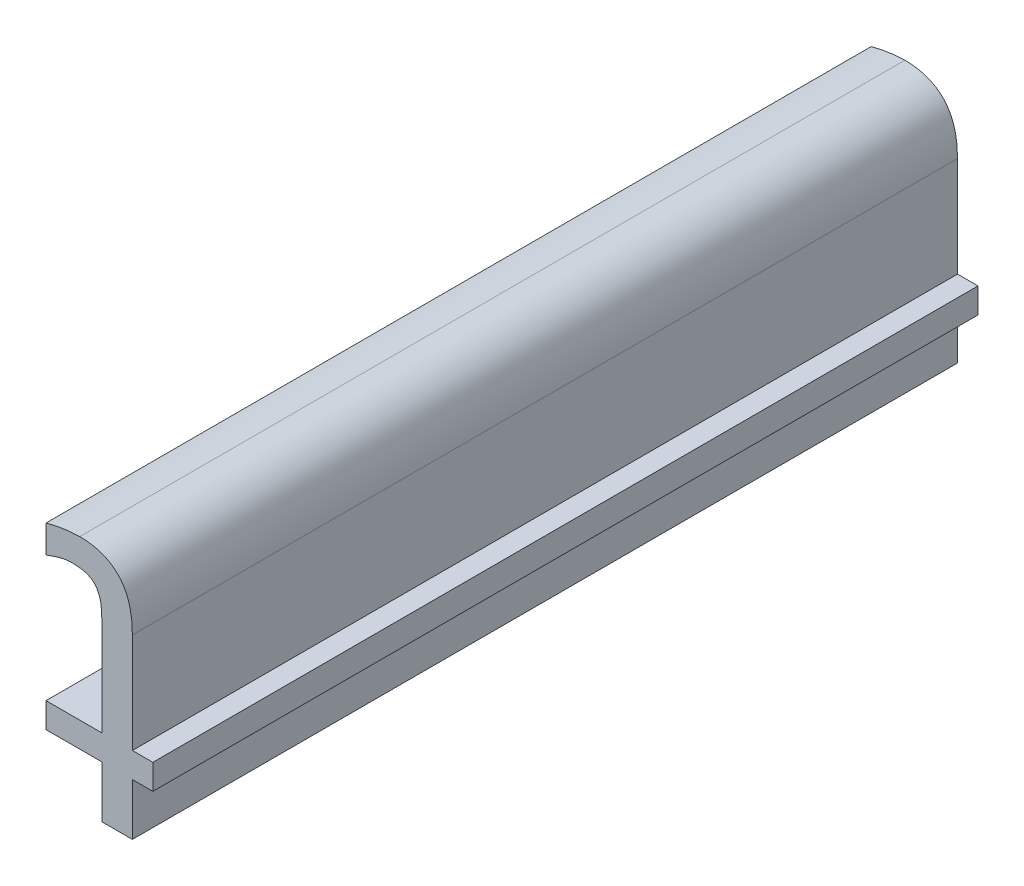
ISO-10303-21;
HEADER;
FILE_DESCRIPTION(('STEP AP214'),'2;1');
FILE_NAME('part.step','',(''),(''),'','','');
FILE_SCHEMA(('AUTOMOTIVE_DESIGN { 1 0 10303 214 1 1 1 1 }'));
ENDSEC;
DATA;
#1=APPLICATION_CONTEXT('core data for automotive mechanical design processes');
#2=APPLICATION_PROTOCOL_DEFINITION('international standard','automotive_design',2000,#1);
#3=PRODUCT_CONTEXT('',#1,'mechanical');
#4=PRODUCT('Part','Part','',(#3));
#5=PRODUCT_RELATED_PRODUCT_CATEGORY('part','',(#4));
#6=PRODUCT_DEFINITION_FORMATION('','',#4);
#7=PRODUCT_DEFINITION_CONTEXT('part definition',#1,'design');
#8=PRODUCT_DEFINITION('design','',#6,#7);
#9=PRODUCT_DEFINITION_SHAPE('','',#8);
#10=(LENGTH_UNIT() NAMED_UNIT(*) SI_UNIT(.MILLI.,.METRE.));
#11=(NAMED_UNIT(*) PLANE_ANGLE_UNIT() SI_UNIT($,.RADIAN.));
#12=(NAMED_UNIT(*) SI_UNIT($,.STERADIAN.) SOLID_ANGLE_UNIT());
#13=UNCERTAINTY_MEASURE_WITH_UNIT(LENGTH_MEASURE(1.E-05),#10,'distance_accuracy_value','');
#14=(GEOMETRIC_REPRESENTATION_CONTEXT(3) GLOBAL_UNCERTAINTY_ASSIGNED_CONTEXT((#13)) GLOBAL_UNIT_ASSIGNED_CONTEXT((#10,
#11,#12)) REPRESENTATION_CONTEXT('',''));
#15=CARTESIAN_POINT('',(0.,0.,0.));
#16=DIRECTION('',(0.,0.,1.));
#17=DIRECTION('',(1.,0.,0.));
#18=AXIS2_PLACEMENT_3D('',#15,#16,#17);
#19=CARTESIAN_POINT('',(5.05130988859926,3.57171991261188,0.));
#20=CARTESIAN_POINT('',(5.05130988859926,3.57171991261188,0.1));
#21=CARTESIAN_POINT('',(5.05149312006613,3.57180007637894,0.));
#22=CARTESIAN_POINT('',(5.05149312006613,3.57180007637894,0.1));
#23=CARTESIAN_POINT('',(5.051676351533,3.571880240146,0.));
#24=CARTESIAN_POINT('',(5.051676351533,3.571880240146,0.1));
#25=CARTESIAN_POINT('',(5.052054439095,3.572045653455,0.));
#26=CARTESIAN_POINT('',(5.052054439095,3.572045653455,0.1));
#27=CARTESIAN_POINT('',(5.053732202649,3.572589154324,0.));
#28=CARTESIAN_POINT('',(5.053732202649,3.572589154324,0.1));
#29=CARTESIAN_POINT('',(5.054630160607,3.572589154324,0.));
#30=CARTESIAN_POINT('',(5.054630160607,3.572589154324,0.1));
#31=B_SPLINE_SURFACE_WITH_KNOTS('',2,1,((#19,#20),(#21,#22),(#23,#24),(#25,#26),(#27,#28),(#29,
#30)),.UNSPECIFIED.,.F.,.F.,.F.,(3,2,1,3),(2,2),(-2.48462706866026,-2.,-1.,0.),(0.,0.01),.UNSPECIFIED.);
#32=CARTESIAN_POINT('',(5.05149784461922,3.57180214337093,0.1));
#33=CARTESIAN_POINT('',(5.05192434530063,3.57197394980912,0.1));
#34=CARTESIAN_POINT('',(5.05235965517821,3.57214782170709,0.1));
#35=CARTESIAN_POINT('',(5.05309863974709,3.57238152407593,0.1));
#36=CARTESIAN_POINT('',(5.05339717863607,3.57246003887685,0.1));
#37=CARTESIAN_POINT('',(5.05400570237596,3.57256779812829,0.1));
#38=CARTESIAN_POINT('',(5.0543157749303,3.57259651228612,0.1));
#39=CARTESIAN_POINT('',(5.054630160607,3.572589154324,0.1));
#40=B_SPLINE_CURVE_WITH_KNOTS('',3,(#32,#33,#34,#35,#36,#37,#38,#39),.UNSPECIFIED.,.F.,.F.,(4,2,
2,4),(0.,0.00139383914533155,0.00231744530987177,0.0032508272847861),.UNSPECIFIED.);
#41=CARTESIAN_POINT('',(5.05148076094961,3.57184119175846,0.1));
#42=VERTEX_POINT('',#41);
#43=CARTESIAN_POINT('',(5.054630160607,3.572589154324,0.1));
#44=VERTEX_POINT('',#43);
#45=EDGE_CURVE('E208',#42,#44,#40,.T.);
#46=DIRECTION('',(0.,0.,1.));
#47=VECTOR('',#46,1.);
#48=CARTESIAN_POINT('',(5.05146367728,3.57178719515996,0.));
#49=LINE('',#48,#47);
#50=CARTESIAN_POINT('',(5.05148076094961,3.57184119175846,0.));
#51=VERTEX_POINT('',#50);
#52=EDGE_CURVE('E146',#51,#42,#49,.T.);
#53=CARTESIAN_POINT('',(5.05149784461922,3.57180214337093,0.));
#54=CARTESIAN_POINT('',(5.05192434530063,3.57197394980912,0.));
#55=CARTESIAN_POINT('',(5.05235965517821,3.57214782170709,0.));
#56=CARTESIAN_POINT('',(5.05309863974709,3.57238152407593,0.));
#57=CARTESIAN_POINT('',(5.05339717863607,3.57246003887685,0.));
#58=CARTESIAN_POINT('',(5.05400570237596,3.57256779812829,0.));
#59=CARTESIAN_POINT('',(5.0543157749303,3.57259651228612,0.));
#60=CARTESIAN_POINT('',(5.054630160607,3.572589154324,0.));
#61=B_SPLINE_CURVE_WITH_KNOTS('',3,(#53,#54,#55,#56,#57,#58,#59,#60),.UNSPECIFIED.,.F.,.F.,(4,2,
2,4),(0.,0.00139383914533043,0.00231744530987161,0.00325082728478593),.UNSPECIFIED.);
#62=CARTESIAN_POINT('',(5.054630160607,3.572589154324,0.));
#63=VERTEX_POINT('',#62);
#64=EDGE_CURVE('E142',#51,#63,#61,.T.);
#65=DIRECTION('',(0.,0.,-1.));
#66=VECTOR('',#65,1.);
#67=CARTESIAN_POINT('',(5.054630160607,3.572589154324,0.05));
#68=LINE('',#67,#66);
#69=EDGE_CURVE('E143',#44,#63,#68,.T.);
#70=ORIENTED_EDGE('',*,*,#45,.F.);
#71=ORIENTED_EDGE('',*,*,#52,.F.);
#72=ORIENTED_EDGE('',*,*,#64,.T.);
#73=ORIENTED_EDGE('',*,*,#69,.F.);
#74=EDGE_LOOP('',(#70,#71,#72,#73));
#75=FACE_BOUND('',#74,.T.);
#76=ADVANCED_FACE('F17',(#75),#31,.T.);
#77=CARTESIAN_POINT('',(5.054630160607,3.572589154324,0.));
#78=CARTESIAN_POINT('',(5.054630160607,3.572589154324,0.1));
#79=CARTESIAN_POINT('',(5.055906206127,3.572589154324,0.));
#80=CARTESIAN_POINT('',(5.055906206127,3.572589154324,0.1));
#81=CARTESIAN_POINT('',(5.057394925901,3.571903870619,0.));
#82=CARTESIAN_POINT('',(5.057394925901,3.571903870619,0.1));
#83=CARTESIAN_POINT('',(5.057725752517,3.571218586914,0.));
#84=CARTESIAN_POINT('',(5.057725752517,3.571218586914,0.1));
#85=B_SPLINE_SURFACE_WITH_KNOTS('',2,1,((#77,#78),(#79,#80),(#81,#82),(#83,#84)),.UNSPECIFIED.,
.F.,.F.,.F.,(3,1,3),(2,2),(-2.,-1.,0.),(0.,0.01),.UNSPECIFIED.);
#86=CARTESIAN_POINT('',(5.054630160607,3.572589154324,0.1));
#87=CARTESIAN_POINT('',(5.05496094504542,3.57258669764763,0.1));
#88=CARTESIAN_POINT('',(5.05530980381784,3.57257162553546,0.1));
#89=CARTESIAN_POINT('',(5.05599415889853,3.57247347746855,0.1));
#90=CARTESIAN_POINT('',(5.05632971669296,3.57239076563969,0.1));
#91=CARTESIAN_POINT('',(5.05708770635305,3.57205022235931,0.1));
#92=CARTESIAN_POINT('',(5.05747595385612,3.57172797974795,0.1));
#93=CARTESIAN_POINT('',(5.05772575250342,3.57121858694212,0.1));
#94=B_SPLINE_CURVE_WITH_KNOTS('',3,(#86,#87,#88,#89,#90,#91,#92,#93),.UNSPECIFIED.,.F.,.F.,(4,2,
2,4),(0.,0.00102491313422835,0.00204434487886826,0.00354685890841517),.UNSPECIFIED.);
#95=CARTESIAN_POINT('',(5.057725752517,3.571218586914,0.1));
#96=VERTEX_POINT('',#95);
#97=EDGE_CURVE('E154',#44,#96,#94,.T.);
#98=CARTESIAN_POINT('',(5.054630160607,3.572589154324,0.));
#99=CARTESIAN_POINT('',(5.05496094504542,3.57258669764763,0.));
#100=CARTESIAN_POINT('',(5.05530980381784,3.57257162553546,0.));
#101=CARTESIAN_POINT('',(5.05599415889853,3.57247347746855,0.));
#102=CARTESIAN_POINT('',(5.05632971669296,3.57239076563969,0.));
#103=CARTESIAN_POINT('',(5.05708770635305,3.57205022235931,0.));
#104=CARTESIAN_POINT('',(5.05747595385612,3.57172797974795,0.));
#105=CARTESIAN_POINT('',(5.05772575250342,3.57121858694212,0.));
#106=B_SPLINE_CURVE_WITH_KNOTS('',3,(#98,#99,#100,#101,#102,#103,#104,#105),.UNSPECIFIED.,.F.,
.F.,(4,2,2,4),(0.,0.00102491313422835,0.00204434487886826,0.00354685890841576),.UNSPECIFIED.);
#107=CARTESIAN_POINT('',(5.05772575251786,3.57121858691456,0.));
#108=VERTEX_POINT('',#107);
#109=EDGE_CURVE('E137',#63,#108,#106,.T.);
#110=DIRECTION('',(0.,0.,-1.));
#111=VECTOR('',#110,1.);
#112=CARTESIAN_POINT('',(5.057725752517,3.571218586914,0.05));
#113=LINE('',#112,#111);
#114=EDGE_CURVE('E156',#96,#108,#113,.T.);
#115=ORIENTED_EDGE('',*,*,#97,.F.);
#116=ORIENTED_EDGE('',*,*,#69,.T.);
#117=ORIENTED_EDGE('',*,*,#109,.T.);
#118=ORIENTED_EDGE('',*,*,#114,.F.);
#119=EDGE_LOOP('',(#115,#116,#117,#118));
#120=FACE_BOUND('',#119,.T.);
#121=ADVANCED_FACE('F152',(#120),#85,.T.);
#122=CARTESIAN_POINT('',(5.057725752517,3.571218586914,0.));
#123=CARTESIAN_POINT('',(5.057725752517,3.571218586914,0.1));
#124=CARTESIAN_POINT('',(5.058127470551,3.570438781318,0.));
#125=CARTESIAN_POINT('',(5.058127470551,3.570438781318,0.1));
#126=CARTESIAN_POINT('',(5.058245622914,3.568619234929,0.));
#127=CARTESIAN_POINT('',(5.058245622914,3.568619234929,0.1));
#128=CARTESIAN_POINT('',(5.058245622914,3.566965101847,0.));
#129=CARTESIAN_POINT('',(5.058245622914,3.566965101847,0.1));
#130=B_SPLINE_SURFACE_WITH_KNOTS('',2,1,((#122,#123),(#124,#125),(#126,#127),(#128,#129)),
.UNSPECIFIED.,.F.,.F.,.F.,(3,1,3),(2,2),(-2.,-1.,0.),(0.,0.01),.UNSPECIFIED.);
#131=CARTESIAN_POINT('',(5.057725752517,3.571218586914,0.1));
#132=CARTESIAN_POINT('',(5.05790600848359,3.57090392574342,0.1));
#133=CARTESIAN_POINT('',(5.058016584745,3.57056949751319,0.1));
#134=CARTESIAN_POINT('',(5.05815709687258,3.5698816436223,0.1));
#135=CARTESIAN_POINT('',(5.05818702354758,3.56952821580104,0.1));
#136=CARTESIAN_POINT('',(5.0582249394048,3.56882301385988,0.1));
#137=CARTESIAN_POINT('',(5.05823293066131,3.56847123958674,0.1));
#138=CARTESIAN_POINT('',(5.0582414785833,3.56773506963006,0.1));
#139=CARTESIAN_POINT('',(5.05824127929853,3.56735066588093,0.1));
#140=CARTESIAN_POINT('',(5.058245622914,3.566965101847,0.1));
#141=B_SPLINE_CURVE_WITH_KNOTS('',3,(#131,#132,#133,#134,#135,#136,#137,#138,#139,#140),
.UNSPECIFIED.,.F.,.F.,(4,2,2,2,4),(0.,0.00105660986660684,0.00211334014379086,
0.00316997048930307,0.00432432436821614),.UNSPECIFIED.);
#142=CARTESIAN_POINT('',(5.058245622914,3.566965101847,0.1));
#143=VERTEX_POINT('',#142);
#144=EDGE_CURVE('E207',#96,#143,#141,.T.);
#145=CARTESIAN_POINT('',(5.057725752517,3.571218586914,0.));
#146=CARTESIAN_POINT('',(5.05790600848359,3.57090392574342,0.));
#147=CARTESIAN_POINT('',(5.058016584745,3.57056949751319,0.));
#148=CARTESIAN_POINT('',(5.05815709687258,3.5698816436223,0.));
#149=CARTESIAN_POINT('',(5.05818702354758,3.56952821580104,0.));
#150=CARTESIAN_POINT('',(5.0582249394048,3.56882301385988,0.));
#151=CARTESIAN_POINT('',(5.05823293066131,3.56847123958674,0.));
#152=CARTESIAN_POINT('',(5.0582414785833,3.56773506963006,0.));
#153=CARTESIAN_POINT('',(5.05824127929853,3.56735066588093,0.));
#154=CARTESIAN_POINT('',(5.058245622914,3.566965101847,0.));
#155=B_SPLINE_CURVE_WITH_KNOTS('',3,(#145,#146,#147,#148,#149,#150,#151,#152,#153,#154),
.UNSPECIFIED.,.F.,.F.,(4,2,2,2,4),(0.,0.00105660986660684,0.00211334014379086,
0.00316997048930307,0.00432432436821614),.UNSPECIFIED.);
#156=CARTESIAN_POINT('',(5.058245622914,3.566965101847,0.));
#157=VERTEX_POINT('',#156);
#158=EDGE_CURVE('E161',#108,#157,#155,.T.);
#159=DIRECTION('',(0.,0.,1.));
#160=VECTOR('',#159,1.);
#161=CARTESIAN_POINT('',(5.058245622914,3.566965101847,0.));
#162=LINE('',#161,#160);
#163=EDGE_CURVE('E346',#143,#157,#162,.F.);
#164=ORIENTED_EDGE('',*,*,#144,.F.);
#165=ORIENTED_EDGE('',*,*,#114,.T.);
#166=ORIENTED_EDGE('',*,*,#158,.T.);
#167=ORIENTED_EDGE('',*,*,#163,.F.);
#168=EDGE_LOOP('',(#164,#165,#166,#167));
#169=FACE_BOUND('',#168,.T.);
#170=ADVANCED_FACE('F186',(#169),#130,.T.);
#171=CARTESIAN_POINT('',(5.058245622914,3.566965101847,0.));
#172=DIRECTION('',(-1.,0.,0.));
#173=DIRECTION('',(0.,0.,1.));
#174=AXIS2_PLACEMENT_3D('',#171,#172,#173);
#175=PLANE('',#174);
#176=DIRECTION('',(0.,1.,0.));
#177=VECTOR('',#176,1.);
#178=CARTESIAN_POINT('',(5.058245622914,3.560627014666,0.1));
#179=LINE('',#178,#177);
#180=CARTESIAN_POINT('',(5.058245622914,3.556544063435,0.1));
#181=VERTEX_POINT('',#180);
#182=EDGE_CURVE('E341',#143,#181,#179,.F.);
#183=ORIENTED_EDGE('',*,*,#182,.F.);
#184=ORIENTED_EDGE('',*,*,#163,.T.);
#185=DIRECTION('',(0.,1.,0.));
#186=VECTOR('',#185,1.);
#187=CARTESIAN_POINT('',(5.058245622914,3.560627014666,0.));
#188=LINE('',#187,#186);
#189=CARTESIAN_POINT('',(5.058245622914,3.556544063435,0.));
#190=VERTEX_POINT('',#189);
#191=EDGE_CURVE('E163',#157,#190,#188,.F.);
#192=ORIENTED_EDGE('',*,*,#191,.T.);
#193=DIRECTION('',(0.,0.,1.));
#194=VECTOR('',#193,1.);
#195=CARTESIAN_POINT('',(5.058245622914,3.556544063435,0.));
#196=LINE('',#195,#194);
#197=EDGE_CURVE('E336',#181,#190,#196,.F.);
#198=ORIENTED_EDGE('',*,*,#197,.F.);
#199=EDGE_LOOP('',(#183,#184,#192,#198));
#200=FACE_BOUND('',#199,.T.);
#201=ADVANCED_FACE('F390',(#200),#175,.T.);
#202=CARTESIAN_POINT('',(5.058245622914,3.556544063435,0.));
#203=DIRECTION('',(0.,1.,0.));
#204=DIRECTION('',(0.,0.,1.));
#205=AXIS2_PLACEMENT_3D('',#202,#203,#204);
#206=PLANE('',#205);
#207=DIRECTION('',(1.,0.,0.));
#208=VECTOR('',#207,1.);
#209=CARTESIAN_POINT('',(5.058343166414,3.556544063435,0.1));
#210=LINE('',#209,#208);
#211=CARTESIAN_POINT('',(5.05146367728,3.556544063435,0.1));
#212=VERTEX_POINT('',#211);
#213=EDGE_CURVE('E331',#181,#212,#210,.F.);
#214=ORIENTED_EDGE('',*,*,#213,.F.);
#215=ORIENTED_EDGE('',*,*,#197,.T.);
#216=DIRECTION('',(1.,0.,0.));
#217=VECTOR('',#216,1.);
#218=CARTESIAN_POINT('',(5.058343166414,3.556544063435,0.));
#219=LINE('',#218,#217);
#220=CARTESIAN_POINT('',(5.05146367728,3.556544063435,0.));
#221=VERTEX_POINT('',#220);
#222=EDGE_CURVE('E381',#190,#221,#219,.F.);
#223=ORIENTED_EDGE('',*,*,#222,.T.);
#224=DIRECTION('',(0.,0.,1.));
#225=VECTOR('',#224,1.);
#226=CARTESIAN_POINT('',(5.05146367728,3.556544063435,0.));
#227=LINE('',#226,#225);
#228=EDGE_CURVE('E326',#212,#221,#227,.F.);
#229=ORIENTED_EDGE('',*,*,#228,.F.);
#230=EDGE_LOOP('',(#214,#215,#223,#229));
#231=FACE_BOUND('',#230,.T.);
#232=ADVANCED_FACE('F394',(#231),#206,.T.);
#233=CARTESIAN_POINT('',(5.05146367728,3.556544063435,0.));
#234=DIRECTION('',(-1.,0.,0.));
#235=DIRECTION('',(0.,0.,1.));
#236=AXIS2_PLACEMENT_3D('',#233,#234,#235);
#237=PLANE('',#236);
#238=DIRECTION('',(0.,1.,0.));
#239=VECTOR('',#238,1.);
#240=CARTESIAN_POINT('',(5.05146367728,3.560627014666,0.1));
#241=LINE('',#240,#239);
#242=CARTESIAN_POINT('',(5.05146367728,3.55349573247,0.1));
#243=VERTEX_POINT('',#242);
#244=EDGE_CURVE('E321',#212,#243,#241,.F.);
#245=ORIENTED_EDGE('',*,*,#244,.F.);
#246=ORIENTED_EDGE('',*,*,#228,.T.);
#247=DIRECTION('',(0.,1.,0.));
#248=VECTOR('',#247,1.);
#249=CARTESIAN_POINT('',(5.05146367728,3.560627014666,0.));
#250=LINE('',#249,#248);
#251=CARTESIAN_POINT('',(5.05146367728,3.55349573247,0.));
#252=VERTEX_POINT('',#251);
#253=EDGE_CURVE('E377',#221,#252,#250,.F.);
#254=ORIENTED_EDGE('',*,*,#253,.T.);
#255=DIRECTION('',(0.,0.,-1.));
#256=VECTOR('',#255,1.);
#257=CARTESIAN_POINT('',(5.05146367728,3.55349573247,0.));
#258=LINE('',#257,#256);
#259=EDGE_CURVE('E316',#243,#252,#258,.T.);
#260=ORIENTED_EDGE('',*,*,#259,.F.);
#261=EDGE_LOOP('',(#245,#246,#254,#260));
#262=FACE_BOUND('',#261,.T.);
#263=ADVANCED_FACE('F400',(#262),#237,.T.);
#264=CARTESIAN_POINT('',(5.05146367728,3.55349573247,0.));
#265=DIRECTION('',(0.,-1.,0.));
#266=DIRECTION('',(0.,0.,-1.));
#267=AXIS2_PLACEMENT_3D('',#264,#265,#266);
#268=PLANE('',#267);
#269=DIRECTION('',(1.,0.,0.));
#270=VECTOR('',#269,1.);
#271=CARTESIAN_POINT('',(5.058343166414,3.55349573247,0.1));
#272=LINE('',#271,#270);
#273=CARTESIAN_POINT('',(5.058245622914,3.55349573247,0.1));
#274=VERTEX_POINT('',#273);
#275=EDGE_CURVE('E311',#243,#274,#272,.T.);
#276=ORIENTED_EDGE('',*,*,#275,.F.);
#277=ORIENTED_EDGE('',*,*,#259,.T.);
#278=DIRECTION('',(1.,0.,0.));
#279=VECTOR('',#278,1.);
#280=CARTESIAN_POINT('',(5.058343166414,3.55349573247,0.));
#281=LINE('',#280,#279);
#282=CARTESIAN_POINT('',(5.058245622914,3.55349573247,0.));
#283=VERTEX_POINT('',#282);
#284=EDGE_CURVE('E373',#252,#283,#281,.T.);
#285=ORIENTED_EDGE('',*,*,#284,.T.);
#286=DIRECTION('',(0.,0.,1.));
#287=VECTOR('',#286,1.);
#288=CARTESIAN_POINT('',(5.058245622914,3.55349573247,0.));
#289=LINE('',#288,#287);
#290=EDGE_CURVE('E306',#274,#283,#289,.F.);
#291=ORIENTED_EDGE('',*,*,#290,.F.);
#292=EDGE_LOOP('',(#276,#277,#285,#291));
#293=FACE_BOUND('',#292,.T.);
#294=ADVANCED_FACE('F403',(#293),#268,.T.);
#295=CARTESIAN_POINT('',(5.058245622914,3.55349573247,0.));
#296=DIRECTION('',(-1.,0.,0.));
#297=DIRECTION('',(0.,0.,1.));
#298=AXIS2_PLACEMENT_3D('',#295,#296,#297);
#299=PLANE('',#298);
#300=DIRECTION('',(0.,1.,0.));
#301=VECTOR('',#300,1.);
#302=CARTESIAN_POINT('',(5.058245622914,3.560627014666,0.1));
#303=LINE('',#302,#301);
#304=CARTESIAN_POINT('',(5.058245622914,3.547210026761,0.1));
#305=VERTEX_POINT('',#304);
#306=EDGE_CURVE('E301',#274,#305,#303,.F.);
#307=ORIENTED_EDGE('',*,*,#306,.F.);
#308=ORIENTED_EDGE('',*,*,#290,.T.);
#309=DIRECTION('',(0.,1.,0.));
#310=VECTOR('',#309,1.);
#311=CARTESIAN_POINT('',(5.058245622914,3.560627014666,0.));
#312=LINE('',#311,#310);
#313=CARTESIAN_POINT('',(5.058245622914,3.547210026761,0.));
#314=VERTEX_POINT('',#313);
#315=EDGE_CURVE('E369',#283,#314,#312,.F.);
#316=ORIENTED_EDGE('',*,*,#315,.T.);
#317=DIRECTION('',(0.,0.,-1.));
#318=VECTOR('',#317,1.);
#319=CARTESIAN_POINT('',(5.058245622914,3.547210026761,0.));
#320=LINE('',#319,#318);
#321=EDGE_CURVE('E296',#305,#314,#320,.T.);
#322=ORIENTED_EDGE('',*,*,#321,.F.);
#323=EDGE_LOOP('',(#307,#308,#316,#322));
#324=FACE_BOUND('',#323,.T.);
#325=ADVANCED_FACE('F476',(#324),#299,.T.);
#326=CARTESIAN_POINT('',(5.058245622914,3.547210026761,0.));
#327=DIRECTION('',(0.,-1.,0.));
#328=DIRECTION('',(0.,0.,-1.));
#329=AXIS2_PLACEMENT_3D('',#326,#327,#328);
#330=PLANE('',#329);
#331=DIRECTION('',(1.,0.,0.));
#332=VECTOR('',#331,1.);
#333=CARTESIAN_POINT('',(5.058343166414,3.547210026761,0.1));
#334=LINE('',#333,#332);
#335=CARTESIAN_POINT('',(5.061931976638,3.547210026761,0.1));
#336=VERTEX_POINT('',#335);
#337=EDGE_CURVE('E291',#305,#336,#334,.T.);
#338=ORIENTED_EDGE('',*,*,#337,.F.);
#339=ORIENTED_EDGE('',*,*,#321,.T.);
#340=DIRECTION('',(1.,0.,0.));
#341=VECTOR('',#340,1.);
#342=CARTESIAN_POINT('',(5.058343166414,3.547210026761,0.));
#343=LINE('',#342,#341);
#344=CARTESIAN_POINT('',(5.061931976638,3.547210026761,0.));
#345=VERTEX_POINT('',#344);
#346=EDGE_CURVE('E365',#314,#345,#343,.T.);
#347=ORIENTED_EDGE('',*,*,#346,.T.);
#348=DIRECTION('',(0.,0.,-1.));
#349=VECTOR('',#348,1.);
#350=CARTESIAN_POINT('',(5.061931976638,3.547210026761,0.));
#351=LINE('',#350,#349);
#352=EDGE_CURVE('E286',#336,#345,#351,.T.);
#353=ORIENTED_EDGE('',*,*,#352,.F.);
#354=EDGE_LOOP('',(#338,#339,#347,#353));
#355=FACE_BOUND('',#354,.T.);
#356=ADVANCED_FACE('F472',(#355),#330,.T.);
#357=CARTESIAN_POINT('',(5.061931976638,3.547210026761,0.));
#358=DIRECTION('',(1.,0.,0.));
#359=DIRECTION('',(0.,0.,-1.));
#360=AXIS2_PLACEMENT_3D('',#357,#358,#359);
#361=PLANE('',#360);
#362=DIRECTION('',(0.,1.,0.));
#363=VECTOR('',#362,1.);
#364=CARTESIAN_POINT('',(5.061931976638,3.560627014666,0.1));
#365=LINE('',#364,#363);
#366=CARTESIAN_POINT('',(5.061931976638,3.55349573247,0.1));
#367=VERTEX_POINT('',#366);
#368=EDGE_CURVE('E246',#336,#367,#365,.T.);
#369=ORIENTED_EDGE('',*,*,#368,.F.);
#370=ORIENTED_EDGE('',*,*,#352,.T.);
#371=DIRECTION('',(0.,1.,0.));
#372=VECTOR('',#371,1.);
#373=CARTESIAN_POINT('',(5.061931976638,3.560627014666,0.));
#374=LINE('',#373,#372);
#375=CARTESIAN_POINT('',(5.061931976638,3.55349573247,0.));
#376=VERTEX_POINT('',#375);
#377=EDGE_CURVE('E361',#345,#376,#374,.T.);
#378=ORIENTED_EDGE('',*,*,#377,.T.);
#379=DIRECTION('',(0.,0.,-1.));
#380=VECTOR('',#379,1.);
#381=CARTESIAN_POINT('',(5.061931976638,3.55349573247,0.));
#382=LINE('',#381,#380);
#383=EDGE_CURVE('E283',#367,#376,#382,.T.);
#384=ORIENTED_EDGE('',*,*,#383,.F.);
#385=EDGE_LOOP('',(#369,#370,#378,#384));
#386=FACE_BOUND('',#385,.T.);
#387=ADVANCED_FACE('F468',(#386),#361,.T.);
#388=CARTESIAN_POINT('',(5.061931976638,3.55349573247,0.));
#389=DIRECTION('',(0.,-1.,0.));
#390=DIRECTION('',(0.,0.,-1.));
#391=AXIS2_PLACEMENT_3D('',#388,#389,#390);
#392=PLANE('',#391);
#393=DIRECTION('',(1.,0.,0.));
#394=VECTOR('',#393,1.);
#395=CARTESIAN_POINT('',(5.058343166414,3.55349573247,0.1));
#396=LINE('',#395,#394);
#397=CARTESIAN_POINT('',(5.06441317626,3.55349573247,0.1));
#398=VERTEX_POINT('',#397);
#399=EDGE_CURVE('E241',#367,#398,#396,.T.);
#400=ORIENTED_EDGE('',*,*,#399,.F.);
#401=ORIENTED_EDGE('',*,*,#383,.T.);
#402=DIRECTION('',(1.,0.,0.));
#403=VECTOR('',#402,1.);
#404=CARTESIAN_POINT('',(5.058343166414,3.55349573247,0.));
#405=LINE('',#404,#403);
#406=CARTESIAN_POINT('',(5.06441317626,3.55349573247,0.));
#407=VERTEX_POINT('',#406);
#408=EDGE_CURVE('E263',#376,#407,#405,.T.);
#409=ORIENTED_EDGE('',*,*,#408,.T.);
#410=DIRECTION('',(0.,0.,-1.));
#411=VECTOR('',#410,1.);
#412=CARTESIAN_POINT('',(5.06441317626,3.55349573247,0.));
#413=LINE('',#412,#411);
#414=EDGE_CURVE('E150',#398,#407,#413,.T.);
#415=ORIENTED_EDGE('',*,*,#414,.F.);
#416=EDGE_LOOP('',(#400,#401,#409,#415));
#417=FACE_BOUND('',#416,.T.);
#418=ADVANCED_FACE('F464',(#417),#392,.T.);
#419=CARTESIAN_POINT('',(5.055551749038,3.575802898597,0.));
#420=CARTESIAN_POINT('',(5.055551749038,3.575802898597,0.1));
#421=CARTESIAN_POINT('',(5.054630160607,3.575802898597,0.));
#422=CARTESIAN_POINT('',(5.054630160607,3.575802898597,0.1));
#423=CARTESIAN_POINT('',(5.052503418074,3.57547207198,0.));
#424=CARTESIAN_POINT('',(5.052503418074,3.57547207198,0.1));
#425=CARTESIAN_POINT('',(5.05146367728,3.575188506309,0.));
#426=CARTESIAN_POINT('',(5.05146367728,3.575188506309,0.1));
#427=B_SPLINE_SURFACE_WITH_KNOTS('',2,1,((#419,#420),(#421,#422),(#423,#424),(#425,#426)),
.UNSPECIFIED.,.F.,.F.,.F.,(3,1,3),(2,2),(-2.,-1.,0.),(0.,0.01),.UNSPECIFIED.);
#428=CARTESIAN_POINT('',(5.055551749038,3.575802898597,0.1));
#429=CARTESIAN_POINT('',(5.05519190775334,3.5758022316032,0.1));
#430=CARTESIAN_POINT('',(5.05483293950309,3.57578391178234,0.1));
#431=CARTESIAN_POINT('',(5.05411759696141,3.575718168041,0.1));
#432=CARTESIAN_POINT('',(5.05376122265403,3.57567074429966,0.1));
#433=CARTESIAN_POINT('',(5.05275220084768,3.57550324024035,0.1));
#434=CARTESIAN_POINT('',(5.05210368562011,3.57535562741405,0.1));
#435=CARTESIAN_POINT('',(5.05146367728,3.575188506309,0.1));
#436=B_SPLINE_CURVE_WITH_KNOTS('',3,(#428,#429,#430,#431,#432,#433,#434,#435),.UNSPECIFIED.,.F.,
.F.,(4,2,2,4),(0.,0.00107773031356272,0.00215545399359374,0.00414393501790549),.UNSPECIFIED.);
#437=CARTESIAN_POINT('',(5.055551749038,3.575802898597,0.1));
#438=VERTEX_POINT('',#437);
#439=CARTESIAN_POINT('',(5.05146367728,3.575188506309,0.1));
#440=VERTEX_POINT('',#439);
#441=EDGE_CURVE('E224',#438,#440,#436,.T.);
#442=DIRECTION('',(0.,0.,1.));
#443=VECTOR('',#442,1.);
#444=CARTESIAN_POINT('',(5.055551749038,3.575802898597,0.05));
#445=LINE('',#444,#443);
#446=CARTESIAN_POINT('',(5.055551749038,3.575802898597,0.));
#447=VERTEX_POINT('',#446);
#448=EDGE_CURVE('E274',#447,#438,#445,.T.);
#449=CARTESIAN_POINT('',(5.055551749038,3.575802898597,0.));
#450=CARTESIAN_POINT('',(5.05519190775334,3.5758022316032,0.));
#451=CARTESIAN_POINT('',(5.05483293950309,3.57578391178234,0.));
#452=CARTESIAN_POINT('',(5.05411759696141,3.575718168041,0.));
#453=CARTESIAN_POINT('',(5.05376122265404,3.57567074429966,0.));
#454=CARTESIAN_POINT('',(5.05275220084768,3.57550324024035,0.));
#455=CARTESIAN_POINT('',(5.05210368562011,3.57535562741405,0.));
#456=CARTESIAN_POINT('',(5.05146367728,3.575188506309,0.));
#457=B_SPLINE_CURVE_WITH_KNOTS('',3,(#449,#450,#451,#452,#453,#454,#455,#456),.UNSPECIFIED.,.F.,
.F.,(4,2,2,4),(0.,0.00107773031356272,0.00215545399359202,0.00414393501790546),.UNSPECIFIED.);
#458=CARTESIAN_POINT('',(5.05146367728,3.575188506309,0.));
#459=VERTEX_POINT('',#458);
#460=EDGE_CURVE('E262',#447,#459,#457,.T.);
#461=DIRECTION('',(0.,0.,1.));
#462=VECTOR('',#461,1.);
#463=CARTESIAN_POINT('',(5.05146367728,3.575188506309,0.));
#464=LINE('',#463,#462);
#465=EDGE_CURVE('E271',#440,#459,#464,.F.);
#466=ORIENTED_EDGE('',*,*,#441,.F.);
#467=ORIENTED_EDGE('',*,*,#448,.F.);
#468=ORIENTED_EDGE('',*,*,#460,.T.);
#469=ORIENTED_EDGE('',*,*,#465,.F.);
#470=EDGE_LOOP('',(#466,#467,#468,#469));
#471=FACE_BOUND('',#470,.T.);
#472=ADVANCED_FACE('F447',(#471),#427,.T.);
#473=CARTESIAN_POINT('',(5.05146367728,3.575188506309,0.));
#474=DIRECTION('',(-1.,0.,0.));
#475=DIRECTION('',(0.,0.,1.));
#476=AXIS2_PLACEMENT_3D('',#473,#474,#475);
#477=PLANE('',#476);
#478=DIRECTION('',(0.,1.,0.));
#479=VECTOR('',#478,1.);
#480=CARTESIAN_POINT('',(5.05146367728,3.560627014666,0.1));
#481=LINE('',#480,#479);
#482=EDGE_CURVE('E240',#440,#42,#481,.F.);
#483=ORIENTED_EDGE('',*,*,#482,.F.);
#484=ORIENTED_EDGE('',*,*,#465,.T.);
#485=DIRECTION('',(0.,1.,0.));
#486=VECTOR('',#485,1.);
#487=CARTESIAN_POINT('',(5.05146367728,3.560627014666,0.));
#488=LINE('',#487,#486);
#489=EDGE_CURVE('E356',#459,#51,#488,.F.);
#490=ORIENTED_EDGE('',*,*,#489,.T.);
#491=ORIENTED_EDGE('',*,*,#52,.T.);
#492=EDGE_LOOP('',(#483,#484,#490,#491));
#493=FACE_BOUND('',#492,.T.);
#494=ADVANCED_FACE('F450',(#493),#477,.T.);
#495=CARTESIAN_POINT('',(5.06441317626,3.55349573247,0.));
#496=DIRECTION('',(1.,0.,0.));
#497=DIRECTION('',(0.,0.,-1.));
#498=AXIS2_PLACEMENT_3D('',#495,#496,#497);
#499=PLANE('',#498);
#500=DIRECTION('',(0.,1.,0.));
#501=VECTOR('',#500,1.);
#502=CARTESIAN_POINT('',(5.06441317626,3.560627014666,0.1));
#503=LINE('',#502,#501);
#504=CARTESIAN_POINT('',(5.06441317626,3.556544063435,0.1));
#505=VERTEX_POINT('',#504);
#506=EDGE_CURVE('E238',#398,#505,#503,.T.);
#507=ORIENTED_EDGE('',*,*,#506,.F.);
#508=ORIENTED_EDGE('',*,*,#414,.T.);
#509=DIRECTION('',(0.,1.,0.));
#510=VECTOR('',#509,1.);
#511=CARTESIAN_POINT('',(5.06441317626,3.560627014666,0.));
#512=LINE('',#511,#510);
#513=CARTESIAN_POINT('',(5.06441317626,3.556544063435,0.));
#514=VERTEX_POINT('',#513);
#515=EDGE_CURVE('E260',#407,#514,#512,.T.);
#516=ORIENTED_EDGE('',*,*,#515,.T.);
#517=DIRECTION('',(0.,0.,1.));
#518=VECTOR('',#517,1.);
#519=CARTESIAN_POINT('',(5.06441317626,3.556544063435,0.));
#520=LINE('',#519,#518);
#521=EDGE_CURVE('E254',#505,#514,#520,.F.);
#522=ORIENTED_EDGE('',*,*,#521,.F.);
#523=EDGE_LOOP('',(#507,#508,#516,#522));
#524=FACE_BOUND('',#523,.T.);
#525=ADVANCED_FACE('F457',(#524),#499,.T.);
#526=CARTESIAN_POINT('',(5.058343166414,3.560627014666,0.));
#527=DIRECTION('',(0.,0.,1.));
#528=DIRECTION('',(1.,0.,0.));
#529=AXIS2_PLACEMENT_3D('',#526,#527,#528);
#530=PLANE('',#529);
#531=ORIENTED_EDGE('',*,*,#460,.F.);
#532=CARTESIAN_POINT('',(5.061931976638,3.568666495874,0.));
#533=CARTESIAN_POINT('',(5.06193096648075,3.56920373725188,0.));
#534=CARTESIAN_POINT('',(5.06190560309857,3.56974483556876,0.));
#535=CARTESIAN_POINT('',(5.06179197837459,3.57068742367832,0.));
#536=CARTESIAN_POINT('',(5.06172033808909,3.57109114849644,0.));
#537=CARTESIAN_POINT('',(5.06152551178435,3.57185821855955,0.));
#538=CARTESIAN_POINT('',(5.061406059554,3.57222246601959,0.));
#539=CARTESIAN_POINT('',(5.06100840847675,3.57311971664916,0.));
#540=CARTESIAN_POINT('',(5.0606787426831,3.57363271444297,0.));
#541=CARTESIAN_POINT('',(5.05987989668387,3.57447048089167,0.));
#542=CARTESIAN_POINT('',(5.05942147058496,3.5748055103018,0.));
#543=CARTESIAN_POINT('',(5.05862438694714,3.5752229549719,0.));
#544=CARTESIAN_POINT('',(5.05830821041105,3.57535294977141,0.));
#545=CARTESIAN_POINT('',(5.05720241426855,3.57570774869175,0.));
#546=CARTESIAN_POINT('',(5.05637055935016,3.57580992192583,0.));
#547=CARTESIAN_POINT('',(5.055551749038,3.575802898597,0.));
#548=B_SPLINE_CURVE_WITH_KNOTS('',3,(#532,#533,#534,#535,#536,#537,#538,#539,#540,#541,#542,
#543,#544,#545,#546,#547),.UNSPECIFIED.,.F.,.F.,(4,2,2,2,2,2,2,4),(0.,0.00161672416237391,
0.00284404340744658,0.0039899632753318,0.00577893997522736,0.00744876893057369,
0.00847114388458706,0.0109270221705143),.UNSPECIFIED.);
#549=CARTESIAN_POINT('',(5.061931976638,3.568666495874,0.));
#550=VERTEX_POINT('',#549);
#551=EDGE_CURVE('E276',#550,#447,#548,.T.);
#552=ORIENTED_EDGE('',*,*,#551,.F.);
#553=DIRECTION('',(0.,1.,0.));
#554=VECTOR('',#553,1.);
#555=CARTESIAN_POINT('',(5.061931976638,3.556544063435,0.));
#556=LINE('',#555,#554);
#557=CARTESIAN_POINT('',(5.061931976638,3.556544063435,0.));
#558=VERTEX_POINT('',#557);
#559=EDGE_CURVE('E257',#558,#550,#556,.T.);
#560=ORIENTED_EDGE('',*,*,#559,.F.);
#561=DIRECTION('',(1.,0.,0.));
#562=VECTOR('',#561,1.);
#563=CARTESIAN_POINT('',(5.06441317626,3.556544063435,0.));
#564=LINE('',#563,#562);
#565=EDGE_CURVE('E268',#514,#558,#564,.F.);
#566=ORIENTED_EDGE('',*,*,#565,.F.);
#567=ORIENTED_EDGE('',*,*,#515,.F.);
#568=ORIENTED_EDGE('',*,*,#408,.F.);
#569=ORIENTED_EDGE('',*,*,#377,.F.);
#570=ORIENTED_EDGE('',*,*,#346,.F.);
#571=ORIENTED_EDGE('',*,*,#315,.F.);
#572=ORIENTED_EDGE('',*,*,#284,.F.);
#573=ORIENTED_EDGE('',*,*,#253,.F.);
#574=ORIENTED_EDGE('',*,*,#222,.F.);
#575=ORIENTED_EDGE('',*,*,#191,.F.);
#576=ORIENTED_EDGE('',*,*,#158,.F.);
#577=ORIENTED_EDGE('',*,*,#109,.F.);
#578=ORIENTED_EDGE('',*,*,#64,.F.);
#579=ORIENTED_EDGE('',*,*,#489,.F.);
#580=EDGE_LOOP('',(#531,#552,#560,#566,#567,#568,#569,#570,#571,#572,#573,#574,#575,#576,#577,
#578,#579));
#581=FACE_BOUND('',#580,.T.);
#582=ADVANCED_FACE('F159',(#581),#530,.F.);
#583=CARTESIAN_POINT('',(5.061931976638,3.568666495874,0.));
#584=CARTESIAN_POINT('',(5.061931976638,3.568666495874,0.1));
#585=CARTESIAN_POINT('',(5.061931976638,3.572376480071,0.));
#586=CARTESIAN_POINT('',(5.061931976638,3.572376480071,0.1));
#587=CARTESIAN_POINT('',(5.058552819058,3.575802898597,0.));
#588=CARTESIAN_POINT('',(5.058552819058,3.575802898597,0.1));
#589=CARTESIAN_POINT('',(5.055551749038,3.575802898597,0.));
#590=CARTESIAN_POINT('',(5.055551749038,3.575802898597,0.1));
#591=B_SPLINE_SURFACE_WITH_KNOTS('',2,1,((#583,#584),(#585,#586),(#587,#588),(#589,#590)),
.UNSPECIFIED.,.F.,.F.,.F.,(3,1,3),(2,2),(-2.,-1.,0.),(0.,0.01),.UNSPECIFIED.);
#592=CARTESIAN_POINT('',(5.061931976638,3.568666495874,0.1));
#593=CARTESIAN_POINT('',(5.06193096648075,3.56920373725188,0.1));
#594=CARTESIAN_POINT('',(5.06190560309857,3.56974483556876,0.1));
#595=CARTESIAN_POINT('',(5.06179197837459,3.57068742367832,0.1));
#596=CARTESIAN_POINT('',(5.06172033808909,3.57109114849644,0.1));
#597=CARTESIAN_POINT('',(5.06152551178435,3.57185821855955,0.1));
#598=CARTESIAN_POINT('',(5.061406059554,3.57222246601959,0.1));
#599=CARTESIAN_POINT('',(5.06100840847675,3.57311971664916,0.1));
#600=CARTESIAN_POINT('',(5.0606787426831,3.57363271444297,0.1));
#601=CARTESIAN_POINT('',(5.05987989668387,3.57447048089167,0.1));
#602=CARTESIAN_POINT('',(5.05942147058496,3.5748055103018,0.1));
#603=CARTESIAN_POINT('',(5.05862438694714,3.5752229549719,0.1));
#604=CARTESIAN_POINT('',(5.05830821041104,3.57535294977141,0.1));
#605=CARTESIAN_POINT('',(5.05720241426855,3.57570774869175,0.0999999999999999));
#606=CARTESIAN_POINT('',(5.05637055935016,3.57580992192583,0.0999999999999999));
#607=CARTESIAN_POINT('',(5.055551749038,3.575802898597,0.1));
#608=B_SPLINE_CURVE_WITH_KNOTS('',3,(#592,#593,#594,#595,#596,#597,#598,#599,#600,#601,#602,
#603,#604,#605,#606,#607),.UNSPECIFIED.,.F.,.F.,(4,2,2,2,2,2,2,4),(0.,0.00161672416237391,
0.00284404340744658,0.0039899632753318,0.00577893997522809,0.00744876893057528,
0.00847114388458785,0.0109270221705143),.UNSPECIFIED.);
#609=CARTESIAN_POINT('',(5.061931976638,3.568666495874,0.1));
#610=VERTEX_POINT('',#609);
#611=EDGE_CURVE('E232',#610,#438,#608,.T.);
#612=DIRECTION('',(0.,0.,-1.));
#613=VECTOR('',#612,1.);
#614=CARTESIAN_POINT('',(5.061931976638,3.568666495874,0.));
#615=LINE('',#614,#613);
#616=EDGE_CURVE('E424',#550,#610,#615,.F.);
#617=ORIENTED_EDGE('',*,*,#611,.F.);
#618=ORIENTED_EDGE('',*,*,#616,.F.);
#619=ORIENTED_EDGE('',*,*,#551,.T.);
#620=ORIENTED_EDGE('',*,*,#448,.T.);
#621=EDGE_LOOP('',(#617,#618,#619,#620));
#622=FACE_BOUND('',#621,.T.);
#623=ADVANCED_FACE('F19',(#622),#591,.T.);
#624=CARTESIAN_POINT('',(5.058343166414,3.560627014666,0.1));
#625=DIRECTION('',(0.,0.,1.));
#626=DIRECTION('',(1.,0.,0.));
#627=AXIS2_PLACEMENT_3D('',#624,#625,#626);
#628=PLANE('',#627);
#629=ORIENTED_EDGE('',*,*,#441,.T.);
#630=ORIENTED_EDGE('',*,*,#482,.T.);
#631=ORIENTED_EDGE('',*,*,#45,.T.);
#632=ORIENTED_EDGE('',*,*,#97,.T.);
#633=ORIENTED_EDGE('',*,*,#144,.T.);
#634=ORIENTED_EDGE('',*,*,#182,.T.);
#635=ORIENTED_EDGE('',*,*,#213,.T.);
#636=ORIENTED_EDGE('',*,*,#244,.T.);
#637=ORIENTED_EDGE('',*,*,#275,.T.);
#638=ORIENTED_EDGE('',*,*,#306,.T.);
#639=ORIENTED_EDGE('',*,*,#337,.T.);
#640=ORIENTED_EDGE('',*,*,#368,.T.);
#641=ORIENTED_EDGE('',*,*,#399,.T.);
#642=ORIENTED_EDGE('',*,*,#506,.T.);
#643=DIRECTION('',(1.,0.,0.));
#644=VECTOR('',#643,1.);
#645=CARTESIAN_POINT('',(5.06441317626,3.556544063435,0.1));
#646=LINE('',#645,#644);
#647=CARTESIAN_POINT('',(5.061931976638,3.556544063435,0.1));
#648=VERTEX_POINT('',#647);
#649=EDGE_CURVE('E39',#648,#505,#646,.T.);
#650=ORIENTED_EDGE('',*,*,#649,.F.);
#651=DIRECTION('',(0.,1.,0.));
#652=VECTOR('',#651,1.);
#653=CARTESIAN_POINT('',(5.061931976638,3.556544063435,0.1));
#654=LINE('',#653,#652);
#655=EDGE_CURVE('E30',#610,#648,#654,.F.);
#656=ORIENTED_EDGE('',*,*,#655,.F.);
#657=ORIENTED_EDGE('',*,*,#611,.T.);
#658=EDGE_LOOP('',(#629,#630,#631,#632,#633,#634,#635,#636,#637,#638,#639,#640,#641,#642,#650,
#656,#657));
#659=FACE_BOUND('',#658,.T.);
#660=ADVANCED_FACE('F215',(#659),#628,.T.);
#661=CARTESIAN_POINT('',(5.06441317626,3.556544063435,0.));
#662=DIRECTION('',(0.,1.,0.));
#663=DIRECTION('',(0.,0.,1.));
#664=AXIS2_PLACEMENT_3D('',#661,#662,#663);
#665=PLANE('',#664);
#666=ORIENTED_EDGE('',*,*,#649,.T.);
#667=ORIENTED_EDGE('',*,*,#521,.T.);
#668=ORIENTED_EDGE('',*,*,#565,.T.);
#669=DIRECTION('',(0.,0.,-1.));
#670=VECTOR('',#669,1.);
#671=CARTESIAN_POINT('',(5.061931976638,3.556544063435,0.));
#672=LINE('',#671,#670);
#673=EDGE_CURVE('E11',#648,#558,#672,.T.);
#674=ORIENTED_EDGE('',*,*,#673,.F.);
#675=EDGE_LOOP('',(#666,#667,#668,#674));
#676=FACE_BOUND('',#675,.T.);
#677=ADVANCED_FACE('F219',(#676),#665,.T.);
#678=CARTESIAN_POINT('',(5.061931976638,3.556544063435,0.));
#679=DIRECTION('',(1.,0.,0.));
#680=DIRECTION('',(0.,0.,-1.));
#681=AXIS2_PLACEMENT_3D('',#678,#679,#680);
#682=PLANE('',#681);
#683=ORIENTED_EDGE('',*,*,#655,.T.);
#684=ORIENTED_EDGE('',*,*,#673,.T.);
#685=ORIENTED_EDGE('',*,*,#559,.T.);
#686=ORIENTED_EDGE('',*,*,#616,.T.);
#687=EDGE_LOOP('',(#683,#684,#685,#686));
#688=FACE_BOUND('',#687,.T.);
#689=ADVANCED_FACE('F413',(#688),#682,.T.);
#690=CLOSED_SHELL('',(#76,#121,#170,#201,#232,#263,#294,#325,#356,#387,#418,#472,#494,#525,#582,
#623,#660,#677,#689));
#691=MANIFOLD_SOLID_BREP('B1',#690);
#692=ADVANCED_BREP_SHAPE_REPRESENTATION('',(#18,#691),#14);
#693=SHAPE_DEFINITION_REPRESENTATION(#9,#692);
ENDSEC;
END-ISO-10303-21;
